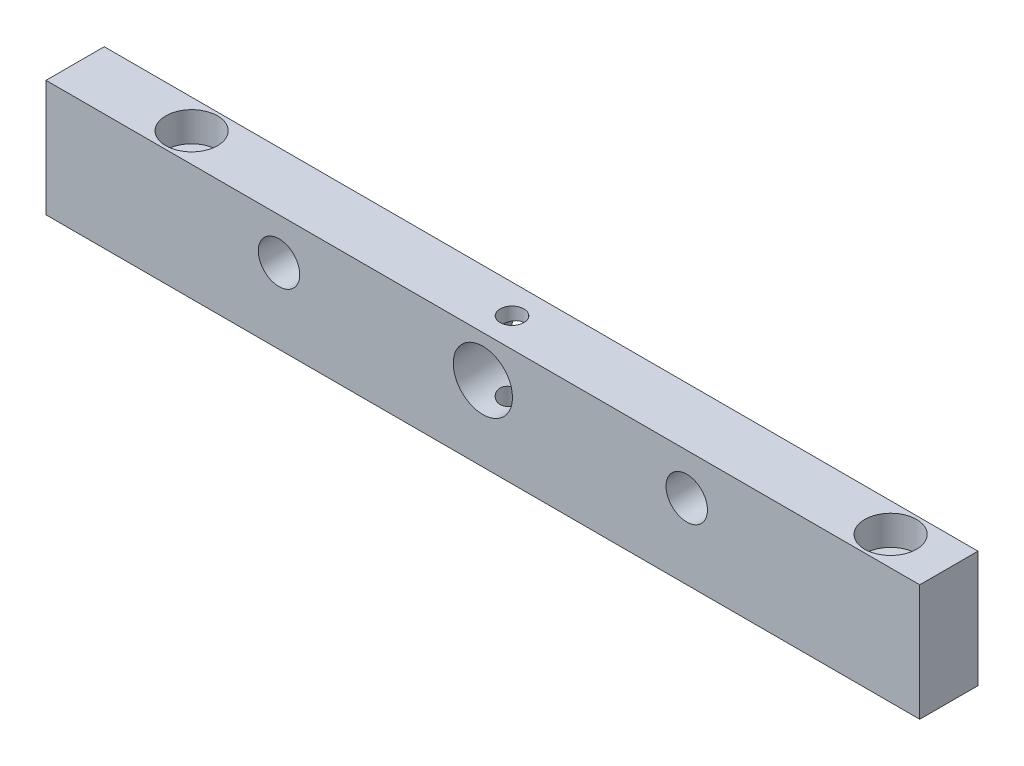
ISO-10303-21;
HEADER;
FILE_DESCRIPTION(('STEP AP214'),'2;1');
FILE_NAME('part.step','',(''),(''),'','','');
FILE_SCHEMA(('AUTOMOTIVE_DESIGN { 1 0 10303 214 1 1 1 1 }'));
ENDSEC;
DATA;
#1=APPLICATION_CONTEXT('core data for automotive mechanical design processes');
#2=APPLICATION_PROTOCOL_DEFINITION('international standard','automotive_design',2000,#1);
#3=PRODUCT_CONTEXT('',#1,'mechanical');
#4=PRODUCT('Part','Part','',(#3));
#5=PRODUCT_RELATED_PRODUCT_CATEGORY('part','',(#4));
#6=PRODUCT_DEFINITION_FORMATION('','',#4);
#7=PRODUCT_DEFINITION_CONTEXT('part definition',#1,'design');
#8=PRODUCT_DEFINITION('design','',#6,#7);
#9=PRODUCT_DEFINITION_SHAPE('','',#8);
#10=(LENGTH_UNIT() NAMED_UNIT(*) SI_UNIT(.MILLI.,.METRE.));
#11=(NAMED_UNIT(*) PLANE_ANGLE_UNIT() SI_UNIT($,.RADIAN.));
#12=(NAMED_UNIT(*) SI_UNIT($,.STERADIAN.) SOLID_ANGLE_UNIT());
#13=UNCERTAINTY_MEASURE_WITH_UNIT(LENGTH_MEASURE(1.E-05),#10,'distance_accuracy_value','');
#14=(GEOMETRIC_REPRESENTATION_CONTEXT(3) GLOBAL_UNCERTAINTY_ASSIGNED_CONTEXT((#13)) GLOBAL_UNIT_ASSIGNED_CONTEXT((#10,
#11,#12)) REPRESENTATION_CONTEXT('',''));
#15=CARTESIAN_POINT('',(0.,0.,0.));
#16=DIRECTION('',(0.,0.,1.));
#17=DIRECTION('',(1.,0.,0.));
#18=AXIS2_PLACEMENT_3D('',#15,#16,#17);
#19=CARTESIAN_POINT('',(-15.078556381928,25.,-5.48890968145176));
#20=DIRECTION('',(1.,0.,0.));
#21=DIRECTION('',(0.,0.,-1.));
#22=AXIS2_PLACEMENT_3D('',#19,#20,#21);
#23=PLANE('',#22);
#24=DIRECTION('',(0.,0.,1.));
#25=VECTOR('',#24,1.);
#26=CARTESIAN_POINT('',(-15.078556381928,0.,-5.48890968145176));
#27=LINE('',#26,#25);
#28=CARTESIAN_POINT('',(-15.078556381928,0.,-5.48890968145176));
#29=VERTEX_POINT('',#28);
#30=CARTESIAN_POINT('',(-15.078556381928,0.,7.01109031854824));
#31=VERTEX_POINT('',#30);
#32=EDGE_CURVE('E105',#29,#31,#27,.T.);
#33=ORIENTED_EDGE('',*,*,#32,.T.);
#34=DIRECTION('',(0.,-1.,0.));
#35=VECTOR('',#34,1.);
#36=CARTESIAN_POINT('',(-15.078556381928,25.,7.01109031854824));
#37=LINE('',#36,#35);
#38=CARTESIAN_POINT('',(-15.078556381928,25.,7.01109031854824));
#39=VERTEX_POINT('',#38);
#40=EDGE_CURVE('E11',#39,#31,#37,.T.);
#41=ORIENTED_EDGE('',*,*,#40,.F.);
#42=DIRECTION('',(0.,0.,1.));
#43=VECTOR('',#42,1.);
#44=CARTESIAN_POINT('',(-15.078556381928,25.,-5.48890968145176));
#45=LINE('',#44,#43);
#46=CARTESIAN_POINT('',(-15.078556381928,25.,-5.48890968145176));
#47=VERTEX_POINT('',#46);
#48=EDGE_CURVE('E92',#47,#39,#45,.T.);
#49=ORIENTED_EDGE('',*,*,#48,.F.);
#50=DIRECTION('',(0.,-1.,0.));
#51=VECTOR('',#50,1.);
#52=CARTESIAN_POINT('',(-15.078556381928,25.,-5.48890968145176));
#53=LINE('',#52,#51);
#54=EDGE_CURVE('E101',#47,#29,#53,.T.);
#55=ORIENTED_EDGE('',*,*,#54,.T.);
#56=EDGE_LOOP('',(#33,#41,#49,#55));
#57=FACE_BOUND('',#56,.T.);
#58=ADVANCED_FACE('F35',(#57),#23,.F.);
#59=CARTESIAN_POINT('',(-15.078556381928,25.,7.01109031854824));
#60=DIRECTION('',(0.,0.,-1.));
#61=DIRECTION('',(-1.,0.,0.));
#62=AXIS2_PLACEMENT_3D('',#59,#60,#61);
#63=PLANE('',#62);
#64=CARTESIAN_POINT('',(78.671443618072,16.11,7.01109031854824));
#65=DIRECTION('',(0.,0.,-1.));
#66=DIRECTION('',(-1.,0.,0.));
#67=AXIS2_PLACEMENT_3D('',#64,#65,#66);
#68=CIRCLE('',#67,6.35);
#69=CARTESIAN_POINT('',(72.321443618072,16.11,7.01109031854824));
#70=VERTEX_POINT('',#69);
#71=EDGE_CURVE('E324',#70,#70,#68,.F.);
#72=ORIENTED_EDGE('',*,*,#71,.F.);
#73=EDGE_LOOP('',(#72));
#74=FACE_BOUND('',#73,.T.);
#75=CARTESIAN_POINT('',(122.421443618072,16.11,7.01109031854824));
#76=DIRECTION('',(0.,0.,-1.));
#77=DIRECTION('',(-1.,0.,0.));
#78=AXIS2_PLACEMENT_3D('',#75,#76,#77);
#79=CIRCLE('',#78,4.445);
#80=CARTESIAN_POINT('',(117.976443618072,16.11,7.01109031854824));
#81=VERTEX_POINT('',#80);
#82=EDGE_CURVE('E318',#81,#81,#79,.F.);
#83=ORIENTED_EDGE('',*,*,#82,.F.);
#84=EDGE_LOOP('',(#83));
#85=FACE_BOUND('',#84,.T.);
#86=CARTESIAN_POINT('',(34.921443618072,16.11,7.01109031854824));
#87=DIRECTION('',(0.,0.,-1.));
#88=DIRECTION('',(-1.,0.,0.));
#89=AXIS2_PLACEMENT_3D('',#86,#87,#88);
#90=CIRCLE('',#89,4.44499999999999);
#91=CARTESIAN_POINT('',(30.476443618072,16.11,7.01109031854824));
#92=VERTEX_POINT('',#91);
#93=EDGE_CURVE('E309',#92,#92,#90,.F.);
#94=ORIENTED_EDGE('',*,*,#93,.F.);
#95=EDGE_LOOP('',(#94));
#96=FACE_BOUND('',#95,.T.);
#97=DIRECTION('',(1.,0.,0.));
#98=VECTOR('',#97,1.);
#99=CARTESIAN_POINT('',(-15.078556381928,0.,7.01109031854824));
#100=LINE('',#99,#98);
#101=CARTESIAN_POINT('',(172.421443618072,0.,7.01109031854824));
#102=VERTEX_POINT('',#101);
#103=EDGE_CURVE('E96',#31,#102,#100,.T.);
#104=ORIENTED_EDGE('',*,*,#103,.T.);
#105=DIRECTION('',(0.,-1.,0.));
#106=VECTOR('',#105,1.);
#107=CARTESIAN_POINT('',(172.421443618072,25.,7.01109031854824));
#108=LINE('',#107,#106);
#109=CARTESIAN_POINT('',(172.421443618072,25.,7.01109031854824));
#110=VERTEX_POINT('',#109);
#111=EDGE_CURVE('E48',#110,#102,#108,.T.);
#112=ORIENTED_EDGE('',*,*,#111,.F.);
#113=DIRECTION('',(1.,0.,0.));
#114=VECTOR('',#113,1.);
#115=CARTESIAN_POINT('',(-15.078556381928,25.,7.01109031854824));
#116=LINE('',#115,#114);
#117=EDGE_CURVE('E87',#39,#110,#116,.T.);
#118=ORIENTED_EDGE('',*,*,#117,.F.);
#119=ORIENTED_EDGE('',*,*,#40,.T.);
#120=EDGE_LOOP('',(#104,#112,#118,#119));
#121=FACE_BOUND('',#120,.T.);
#122=ADVANCED_FACE('F95',(#74,#85,#96,#121),#63,.F.);
#123=CARTESIAN_POINT('',(172.421443618072,25.,-5.48890968145176));
#124=DIRECTION('',(-1.,0.,0.));
#125=DIRECTION('',(0.,0.,1.));
#126=AXIS2_PLACEMENT_3D('',#123,#124,#125);
#127=PLANE('',#126);
#128=DIRECTION('',(0.,0.,-1.));
#129=VECTOR('',#128,1.);
#130=CARTESIAN_POINT('',(172.421443618072,0.,-5.48890968145176));
#131=LINE('',#130,#129);
#132=CARTESIAN_POINT('',(172.421443618072,0.,-5.48890968145176));
#133=VERTEX_POINT('',#132);
#134=EDGE_CURVE('E74',#102,#133,#131,.T.);
#135=ORIENTED_EDGE('',*,*,#134,.T.);
#136=DIRECTION('',(0.,-1.,0.));
#137=VECTOR('',#136,1.);
#138=CARTESIAN_POINT('',(172.421443618072,25.,-5.48890968145176));
#139=LINE('',#138,#137);
#140=CARTESIAN_POINT('',(172.421443618072,25.,-5.48890968145176));
#141=VERTEX_POINT('',#140);
#142=EDGE_CURVE('E97',#141,#133,#139,.T.);
#143=ORIENTED_EDGE('',*,*,#142,.F.);
#144=DIRECTION('',(0.,0.,-1.));
#145=VECTOR('',#144,1.);
#146=CARTESIAN_POINT('',(172.421443618072,25.,-5.48890968145176));
#147=LINE('',#146,#145);
#148=EDGE_CURVE('E90',#110,#141,#147,.T.);
#149=ORIENTED_EDGE('',*,*,#148,.F.);
#150=ORIENTED_EDGE('',*,*,#111,.T.);
#151=EDGE_LOOP('',(#135,#143,#149,#150));
#152=FACE_BOUND('',#151,.T.);
#153=ADVANCED_FACE('F99',(#152),#127,.F.);
#154=CARTESIAN_POINT('',(-15.078556381928,25.,-5.48890968145176));
#155=DIRECTION('',(0.,0.,1.));
#156=DIRECTION('',(1.,0.,0.));
#157=AXIS2_PLACEMENT_3D('',#154,#155,#156);
#158=PLANE('',#157);
#159=CARTESIAN_POINT('',(78.671443618072,16.11,-5.48890968145176));
#160=DIRECTION('',(0.,0.,-1.));
#161=DIRECTION('',(-1.,0.,0.));
#162=AXIS2_PLACEMENT_3D('',#159,#160,#161);
#163=CIRCLE('',#162,6.35);
#164=CARTESIAN_POINT('',(72.321443618072,16.11,-5.48890968145176));
#165=VERTEX_POINT('',#164);
#166=EDGE_CURVE('E321',#165,#165,#163,.T.);
#167=ORIENTED_EDGE('',*,*,#166,.F.);
#168=EDGE_LOOP('',(#167));
#169=FACE_BOUND('',#168,.T.);
#170=CARTESIAN_POINT('',(122.421443618072,16.11,-5.48890968145176));
#171=DIRECTION('',(0.,0.,-1.));
#172=DIRECTION('',(-1.,0.,0.));
#173=AXIS2_PLACEMENT_3D('',#170,#171,#172);
#174=CIRCLE('',#173,4.445);
#175=CARTESIAN_POINT('',(117.976443618072,16.11,-5.48890968145176));
#176=VERTEX_POINT('',#175);
#177=EDGE_CURVE('E315',#176,#176,#174,.T.);
#178=ORIENTED_EDGE('',*,*,#177,.F.);
#179=EDGE_LOOP('',(#178));
#180=FACE_BOUND('',#179,.T.);
#181=CARTESIAN_POINT('',(34.921443618072,16.11,-5.48890968145176));
#182=DIRECTION('',(0.,0.,-1.));
#183=DIRECTION('',(-1.,0.,0.));
#184=AXIS2_PLACEMENT_3D('',#181,#182,#183);
#185=CIRCLE('',#184,4.44499999999999);
#186=CARTESIAN_POINT('',(30.476443618072,16.11,-5.48890968145176));
#187=VERTEX_POINT('',#186);
#188=EDGE_CURVE('E312',#187,#187,#185,.T.);
#189=ORIENTED_EDGE('',*,*,#188,.F.);
#190=EDGE_LOOP('',(#189));
#191=FACE_BOUND('',#190,.T.);
#192=DIRECTION('',(-1.,0.,0.));
#193=VECTOR('',#192,1.);
#194=CARTESIAN_POINT('',(-15.078556381928,0.,-5.48890968145176));
#195=LINE('',#194,#193);
#196=EDGE_CURVE('E80',#133,#29,#195,.T.);
#197=ORIENTED_EDGE('',*,*,#196,.T.);
#198=ORIENTED_EDGE('',*,*,#54,.F.);
#199=DIRECTION('',(-1.,0.,0.));
#200=VECTOR('',#199,1.);
#201=CARTESIAN_POINT('',(-15.078556381928,25.,-5.48890968145176));
#202=LINE('',#201,#200);
#203=EDGE_CURVE('E57',#141,#47,#202,.T.);
#204=ORIENTED_EDGE('',*,*,#203,.F.);
#205=ORIENTED_EDGE('',*,*,#142,.T.);
#206=EDGE_LOOP('',(#197,#198,#204,#205));
#207=FACE_BOUND('',#206,.T.);
#208=ADVANCED_FACE('F153',(#169,#180,#191,#207),#158,.F.);
#209=CARTESIAN_POINT('',(0.,25.,0.));
#210=DIRECTION('',(0.,1.,0.));
#211=DIRECTION('',(0.,0.,1.));
#212=AXIS2_PLACEMENT_3D('',#209,#210,#211);
#213=PLANE('',#212);
#214=CARTESIAN_POINT('',(78.671443618072,25.,0.761090318548244));
#215=DIRECTION('',(0.,1.,0.));
#216=DIRECTION('',(0.,0.,1.));
#217=AXIS2_PLACEMENT_3D('',#214,#215,#216);
#218=CIRCLE('',#217,2.55269999999999);
#219=CARTESIAN_POINT('',(78.671443618072,25.,3.31379031854823));
#220=VERTEX_POINT('',#219);
#221=EDGE_CURVE('E328',#220,#220,#218,.T.);
#222=ORIENTED_EDGE('',*,*,#221,.F.);
#223=EDGE_LOOP('',(#222));
#224=FACE_BOUND('',#223,.T.);
#225=CARTESIAN_POINT('',(9.92144361807199,25.,0.761090318548267));
#226=DIRECTION('',(0.,1.,0.));
#227=DIRECTION('',(0.,0.,1.));
#228=AXIS2_PLACEMENT_3D('',#225,#226,#227);
#229=CIRCLE('',#228,5.55625);
#230=CARTESIAN_POINT('',(9.92144361807199,25.,6.31734031854826));
#231=VERTEX_POINT('',#230);
#232=EDGE_CURVE('E306',#231,#231,#229,.T.);
#233=ORIENTED_EDGE('',*,*,#232,.F.);
#234=EDGE_LOOP('',(#233));
#235=FACE_BOUND('',#234,.T.);
#236=CARTESIAN_POINT('',(159.921443726072,25.,0.761090318548267));
#237=DIRECTION('',(0.,1.,0.));
#238=DIRECTION('',(0.,0.,1.));
#239=AXIS2_PLACEMENT_3D('',#236,#237,#238);
#240=CIRCLE('',#239,5.55624999999998);
#241=CARTESIAN_POINT('',(159.921443726072,25.,6.31734031854825));
#242=VERTEX_POINT('',#241);
#243=EDGE_CURVE('E286',#242,#242,#240,.T.);
#244=ORIENTED_EDGE('',*,*,#243,.F.);
#245=EDGE_LOOP('',(#244));
#246=FACE_BOUND('',#245,.T.);
#247=ORIENTED_EDGE('',*,*,#48,.T.);
#248=ORIENTED_EDGE('',*,*,#117,.T.);
#249=ORIENTED_EDGE('',*,*,#148,.T.);
#250=ORIENTED_EDGE('',*,*,#203,.T.);
#251=EDGE_LOOP('',(#247,#248,#249,#250));
#252=FACE_BOUND('',#251,.T.);
#253=ADVANCED_FACE('F88',(#224,#235,#246,#252),#213,.T.);
#254=CARTESIAN_POINT('',(0.,0.,0.));
#255=DIRECTION('',(0.,1.,0.));
#256=DIRECTION('',(0.,0.,1.));
#257=AXIS2_PLACEMENT_3D('',#254,#255,#256);
#258=PLANE('',#257);
#259=CARTESIAN_POINT('',(78.671443618072,0.,0.761090318548244));
#260=DIRECTION('',(0.,1.,0.));
#261=DIRECTION('',(0.,0.,1.));
#262=AXIS2_PLACEMENT_3D('',#259,#260,#261);
#263=CIRCLE('',#262,2.55269999999999);
#264=CARTESIAN_POINT('',(78.671443618072,0.,3.31379031854823));
#265=VERTEX_POINT('',#264);
#266=EDGE_CURVE('E117',#265,#265,#263,.T.);
#267=ORIENTED_EDGE('',*,*,#266,.T.);
#268=EDGE_LOOP('',(#267));
#269=FACE_BOUND('',#268,.T.);
#270=CARTESIAN_POINT('',(9.92144361807199,0.,0.761090318548267));
#271=DIRECTION('',(0.,1.,0.));
#272=DIRECTION('',(0.,0.,1.));
#273=AXIS2_PLACEMENT_3D('',#270,#271,#272);
#274=CIRCLE('',#273,3.3782);
#275=CARTESIAN_POINT('',(9.92144361807199,0.,4.13929031854826));
#276=VERTEX_POINT('',#275);
#277=EDGE_CURVE('E290',#276,#276,#274,.T.);
#278=ORIENTED_EDGE('',*,*,#277,.T.);
#279=EDGE_LOOP('',(#278));
#280=FACE_BOUND('',#279,.T.);
#281=CARTESIAN_POINT('',(159.921443726072,0.,0.761090318548267));
#282=DIRECTION('',(0.,1.,0.));
#283=DIRECTION('',(0.,0.,1.));
#284=AXIS2_PLACEMENT_3D('',#281,#282,#283);
#285=CIRCLE('',#284,3.3782);
#286=CARTESIAN_POINT('',(159.921443726072,0.,4.13929031854827));
#287=VERTEX_POINT('',#286);
#288=EDGE_CURVE('E108',#287,#287,#285,.T.);
#289=ORIENTED_EDGE('',*,*,#288,.T.);
#290=EDGE_LOOP('',(#289));
#291=FACE_BOUND('',#290,.T.);
#292=ORIENTED_EDGE('',*,*,#32,.F.);
#293=ORIENTED_EDGE('',*,*,#196,.F.);
#294=ORIENTED_EDGE('',*,*,#134,.F.);
#295=ORIENTED_EDGE('',*,*,#103,.F.);
#296=EDGE_LOOP('',(#292,#293,#294,#295));
#297=FACE_BOUND('',#296,.T.);
#298=ADVANCED_FACE('F141',(#269,#280,#291,#297),#258,.F.);
#299=CARTESIAN_POINT('',(159.921443726072,25.,0.761090318548267));
#300=DIRECTION('',(0.,1.,0.));
#301=DIRECTION('',(0.,0.,1.));
#302=AXIS2_PLACEMENT_3D('',#299,#300,#301);
#303=CYLINDRICAL_SURFACE('',#302,3.3782);
#304=ORIENTED_EDGE('',*,*,#288,.F.);
#305=EDGE_LOOP('',(#304));
#306=FACE_BOUND('',#305,.T.);
#307=CARTESIAN_POINT('',(159.921443726072,18.65,0.761090318548267));
#308=DIRECTION('',(0.,1.,0.));
#309=DIRECTION('',(0.,0.,1.));
#310=AXIS2_PLACEMENT_3D('',#307,#308,#309);
#311=CIRCLE('',#310,3.3782);
#312=CARTESIAN_POINT('',(159.921443726072,18.65,4.13929031854827));
#313=VERTEX_POINT('',#312);
#314=EDGE_CURVE('E282',#313,#313,#311,.T.);
#315=ORIENTED_EDGE('',*,*,#314,.T.);
#316=EDGE_LOOP('',(#315));
#317=FACE_BOUND('',#316,.T.);
#318=ADVANCED_FACE('F143',(#306,#317),#303,.F.);
#319=CARTESIAN_POINT('',(163.299643726072,18.65,0.761090318548267));
#320=DIRECTION('',(0.,-1.,0.));
#321=DIRECTION('',(0.,0.,-1.));
#322=AXIS2_PLACEMENT_3D('',#319,#320,#321);
#323=PLANE('',#322);
#324=ORIENTED_EDGE('',*,*,#314,.F.);
#325=EDGE_LOOP('',(#324));
#326=FACE_BOUND('',#325,.T.);
#327=CARTESIAN_POINT('',(159.921443726072,18.65,0.761090318548267));
#328=DIRECTION('',(0.,1.,0.));
#329=DIRECTION('',(0.,0.,1.));
#330=AXIS2_PLACEMENT_3D('',#327,#328,#329);
#331=CIRCLE('',#330,5.55624999999998);
#332=CARTESIAN_POINT('',(159.921443726072,18.65,6.31734031854825));
#333=VERTEX_POINT('',#332);
#334=EDGE_CURVE('E285',#333,#333,#331,.T.);
#335=ORIENTED_EDGE('',*,*,#334,.T.);
#336=EDGE_LOOP('',(#335));
#337=FACE_BOUND('',#336,.T.);
#338=ADVANCED_FACE('F150',(#326,#337),#323,.F.);
#339=CARTESIAN_POINT('',(159.921443726072,25.,0.761090318548267));
#340=DIRECTION('',(0.,1.,0.));
#341=DIRECTION('',(0.,0.,1.));
#342=AXIS2_PLACEMENT_3D('',#339,#340,#341);
#343=CYLINDRICAL_SURFACE('',#342,5.55624999999998);
#344=ORIENTED_EDGE('',*,*,#334,.F.);
#345=EDGE_LOOP('',(#344));
#346=FACE_BOUND('',#345,.T.);
#347=ORIENTED_EDGE('',*,*,#243,.T.);
#348=EDGE_LOOP('',(#347));
#349=FACE_BOUND('',#348,.T.);
#350=ADVANCED_FACE('F243',(#346,#349),#343,.F.);
#351=CARTESIAN_POINT('',(9.92144361807199,25.,0.761090318548267));
#352=DIRECTION('',(0.,1.,0.));
#353=DIRECTION('',(0.,0.,1.));
#354=AXIS2_PLACEMENT_3D('',#351,#352,#353);
#355=CYLINDRICAL_SURFACE('',#354,3.3782);
#356=ORIENTED_EDGE('',*,*,#277,.F.);
#357=EDGE_LOOP('',(#356));
#358=FACE_BOUND('',#357,.T.);
#359=CARTESIAN_POINT('',(9.92144361807199,18.65,0.761090318548267));
#360=DIRECTION('',(0.,1.,0.));
#361=DIRECTION('',(0.,0.,1.));
#362=AXIS2_PLACEMENT_3D('',#359,#360,#361);
#363=CIRCLE('',#362,3.3782);
#364=CARTESIAN_POINT('',(9.92144361807199,18.65,4.13929031854826));
#365=VERTEX_POINT('',#364);
#366=EDGE_CURVE('E300',#365,#365,#363,.T.);
#367=ORIENTED_EDGE('',*,*,#366,.T.);
#368=EDGE_LOOP('',(#367));
#369=FACE_BOUND('',#368,.T.);
#370=ADVANCED_FACE('F235',(#358,#369),#355,.F.);
#371=CARTESIAN_POINT('',(13.299643618072,18.65,0.761090318548267));
#372=DIRECTION('',(0.,-1.,0.));
#373=DIRECTION('',(0.,0.,-1.));
#374=AXIS2_PLACEMENT_3D('',#371,#372,#373);
#375=PLANE('',#374);
#376=ORIENTED_EDGE('',*,*,#366,.F.);
#377=EDGE_LOOP('',(#376));
#378=FACE_BOUND('',#377,.T.);
#379=CARTESIAN_POINT('',(9.92144361807199,18.65,0.761090318548267));
#380=DIRECTION('',(0.,1.,0.));
#381=DIRECTION('',(0.,0.,1.));
#382=AXIS2_PLACEMENT_3D('',#379,#380,#381);
#383=CIRCLE('',#382,5.55625);
#384=CARTESIAN_POINT('',(9.92144361807199,18.65,6.31734031854826));
#385=VERTEX_POINT('',#384);
#386=EDGE_CURVE('E303',#385,#385,#383,.T.);
#387=ORIENTED_EDGE('',*,*,#386,.T.);
#388=EDGE_LOOP('',(#387));
#389=FACE_BOUND('',#388,.T.);
#390=ADVANCED_FACE('F227',(#378,#389),#375,.F.);
#391=CARTESIAN_POINT('',(9.92144361807199,25.,0.761090318548267));
#392=DIRECTION('',(0.,1.,0.));
#393=DIRECTION('',(0.,0.,1.));
#394=AXIS2_PLACEMENT_3D('',#391,#392,#393);
#395=CYLINDRICAL_SURFACE('',#394,5.55625);
#396=ORIENTED_EDGE('',*,*,#386,.F.);
#397=EDGE_LOOP('',(#396));
#398=FACE_BOUND('',#397,.T.);
#399=ORIENTED_EDGE('',*,*,#232,.T.);
#400=EDGE_LOOP('',(#399));
#401=FACE_BOUND('',#400,.T.);
#402=ADVANCED_FACE('F219',(#398,#401),#395,.F.);
#403=CARTESIAN_POINT('',(34.921443618072,16.11,7.01209031854824));
#404=DIRECTION('',(0.,0.,-1.));
#405=DIRECTION('',(-1.,0.,0.));
#406=AXIS2_PLACEMENT_3D('',#403,#404,#405);
#407=CYLINDRICAL_SURFACE('',#406,4.44499999999999);
#408=ORIENTED_EDGE('',*,*,#188,.T.);
#409=EDGE_LOOP('',(#408));
#410=FACE_BOUND('',#409,.T.);
#411=ORIENTED_EDGE('',*,*,#93,.T.);
#412=EDGE_LOOP('',(#411));
#413=FACE_BOUND('',#412,.T.);
#414=ADVANCED_FACE('F215',(#410,#413),#407,.F.);
#415=CARTESIAN_POINT('',(122.421443618072,16.11,7.01209031854825));
#416=DIRECTION('',(0.,0.,-1.));
#417=DIRECTION('',(-1.,0.,0.));
#418=AXIS2_PLACEMENT_3D('',#415,#416,#417);
#419=CYLINDRICAL_SURFACE('',#418,4.445);
#420=ORIENTED_EDGE('',*,*,#177,.T.);
#421=EDGE_LOOP('',(#420));
#422=FACE_BOUND('',#421,.T.);
#423=ORIENTED_EDGE('',*,*,#82,.T.);
#424=EDGE_LOOP('',(#423));
#425=FACE_BOUND('',#424,.T.);
#426=ADVANCED_FACE('F183',(#422,#425),#419,.F.);
#427=CARTESIAN_POINT('',(78.671443618072,16.11,7.01209031854824));
#428=DIRECTION('',(0.,0.,-1.));
#429=DIRECTION('',(-1.,0.,0.));
#430=AXIS2_PLACEMENT_3D('',#427,#428,#429);
#431=CYLINDRICAL_SURFACE('',#430,6.35);
#432=CARTESIAN_POINT('',(78.671443618072,9.76000000000001,3.31379031854823));
#433=CARTESIAN_POINT('',(78.5342910275086,9.76000695193127,3.31378097955258));
#434=CARTESIAN_POINT('',(78.3969174387737,9.76449429145972,3.30267322057806));
#435=CARTESIAN_POINT('',(78.1260374072043,9.78200140375589,3.25863635200131));
#436=CARTESIAN_POINT('',(77.9925424519429,9.79504426410509,3.22564819414416));
#437=CARTESIAN_POINT('',(77.7337851387783,9.82826033152891,3.13924287508518));
#438=CARTESIAN_POINT('',(77.6084972849598,9.84841008018786,3.08589287723378));
#439=CARTESIAN_POINT('',(77.3687640987907,9.89385718057557,2.96054719944265));
#440=CARTESIAN_POINT('',(77.2543150780239,9.91915277190092,2.88855789375737));
#441=CARTESIAN_POINT('',(77.0339082236577,9.97368000171478,2.72436487584246));
#442=CARTESIAN_POINT('',(76.9285324054101,10.0030346225478,2.63142102839832));
#443=CARTESIAN_POINT('',(76.7343703821413,10.0618136104787,2.42951979130504));
#444=CARTESIAN_POINT('',(76.6455923647313,10.0912380047861,2.32055454547853));
#445=CARTESIAN_POINT('',(76.4832054863922,10.1483001372008,2.08374317393659));
#446=CARTESIAN_POINT('',(76.4104602194872,10.1757976603096,1.95526759092073));
#447=CARTESIAN_POINT('',(76.2878718337146,10.2239609237356,1.68663386192061));
#448=CARTESIAN_POINT('',(76.2380177281602,10.2446299400778,1.54648135855321));
#449=CARTESIAN_POINT('',(76.1649865569268,10.275474410188,1.26516129201472));
#450=CARTESIAN_POINT('',(76.1406945550162,10.2860862197889,1.12433277125066));
#451=CARTESIAN_POINT('',(76.1159949035087,10.296878412565,0.840229318006984));
#452=CARTESIAN_POINT('',(76.1155753459108,10.2970639965269,0.696955640893327));
#453=CARTESIAN_POINT('',(76.137788164677,10.2873546590891,0.422788646913135));
#454=CARTESIAN_POINT('',(76.1587993554428,10.2781686642624,0.291733978559869));
#455=CARTESIAN_POINT('',(76.2205721844244,10.2519420301842,0.035197272304217));
#456=CARTESIAN_POINT('',(76.261337307361,10.2349000051042,-0.0902837781109768));
#457=CARTESIAN_POINT('',(76.3622393700047,10.1945059345715,-0.335155823476884));
#458=CARTESIAN_POINT('',(76.4227566337932,10.1710315899271,-0.4543690272231));
#459=CARTESIAN_POINT('',(76.5611778844472,10.1204508493915,-0.681389457203357));
#460=CARTESIAN_POINT('',(76.6390884421858,10.0933430824094,-0.789192350078996));
#461=CARTESIAN_POINT('',(76.8172400786182,10.0359700780286,-0.999197486470372));
#462=CARTESIAN_POINT('',(76.9187504252493,10.005623639758,-1.10030370683345));
#463=CARTESIAN_POINT('',(77.137606493084,9.94699202346783,-1.28441053962592));
#464=CARTESIAN_POINT('',(77.2549554234707,9.9187072649751,-1.36740747384614));
#465=CARTESIAN_POINT('',(77.5052925253656,9.86666448074812,-1.51439773117967));
#466=CARTESIAN_POINT('',(77.638548020695,9.84300906954198,-1.57797476177377));
#467=CARTESIAN_POINT('',(77.915055142277,9.80366748127336,-1.68143133498506));
#468=CARTESIAN_POINT('',(78.0583015955966,9.78797721449677,-1.72132304065218));
#469=CARTESIAN_POINT('',(78.3415406677904,9.76708135863064,-1.77405082868554));
#470=CARTESIAN_POINT('',(78.481217223293,9.76130589632944,-1.78835959035144));
#471=CARTESIAN_POINT('',(78.7610818163908,9.75909245541938,-1.79386876686872));
#472=CARTESIAN_POINT('',(78.9012697101184,9.76265202645421,-1.78507524584566));
#473=CARTESIAN_POINT('',(79.1714762953813,9.77833606070616,-1.74570901357163));
#474=CARTESIAN_POINT('',(79.3016675155635,9.79006363758629,-1.71614498915851));
#475=CARTESIAN_POINT('',(79.5551187927577,9.82049110878906,-1.63745315885039));
#476=CARTESIAN_POINT('',(79.6783779585989,9.83919189722634,-1.58832284408411));
#477=CARTESIAN_POINT('',(79.9187198030849,9.8824662447856,-1.47028910624298));
#478=CARTESIAN_POINT('',(80.0354972587533,9.90720227810128,-1.40082564358995));
#479=CARTESIAN_POINT('',(80.2561496118635,9.95987026986238,-1.24471801325101));
#480=CARTESIAN_POINT('',(80.3600192825722,9.98780351421211,-1.15806692243357));
#481=CARTESIAN_POINT('',(80.5591741487056,10.0461356159372,-0.963270427239609));
#482=CARTESIAN_POINT('',(80.6534253085682,10.0765746944739,-0.854077142832699));
#483=CARTESIAN_POINT('',(80.8225241563819,10.1347702340363,-0.620891828157536));
#484=CARTESIAN_POINT('',(80.8973685122909,10.1625262338798,-0.496897261920116));
#485=CARTESIAN_POINT('',(81.0260400810017,10.2122711477268,-0.235680437008604));
#486=CARTESIAN_POINT('',(81.0796452103056,10.2341983716803,-0.0983361933629369));
#487=CARTESIAN_POINT('',(81.1625470769,10.2688562090829,0.184578381504007));
#488=CARTESIAN_POINT('',(81.1918620005112,10.2815937020501,0.330142471061428));
#489=CARTESIAN_POINT('',(81.2236057911166,10.2954286254139,0.613981200994122));
#490=CARTESIAN_POINT('',(81.2278314642335,10.2973037243171,0.752018194917314));
#491=CARTESIAN_POINT('',(81.2140044841576,10.2912422810256,1.02673834068979));
#492=CARTESIAN_POINT('',(81.1959547243269,10.2833070131019,1.16342166604309));
#493=CARTESIAN_POINT('',(81.1395617152256,10.2592079193855,1.42590086503871));
#494=CARTESIAN_POINT('',(81.1020665366951,10.2433889707465,1.55191351119605));
#495=CARTESIAN_POINT('',(81.0086448290789,10.2055510486559,1.79590735199853));
#496=CARTESIAN_POINT('',(80.9527131986747,10.1835303594447,1.91388631282976));
#497=CARTESIAN_POINT('',(80.8202834186383,10.1341948715968,2.14587114893941));
#498=CARTESIAN_POINT('',(80.7427859640235,10.1066481445318,2.25925644858914));
#499=CARTESIAN_POINT('',(80.5708809133344,10.0500642008479,2.47197672928418));
#500=CARTESIAN_POINT('',(80.4764681274474,10.0210265287465,2.57130738141937));
#501=CARTESIAN_POINT('',(80.2660116494101,9.96243739012058,2.75980465897285));
#502=CARTESIAN_POINT('',(80.1489537503885,9.93297771889437,2.84787326647654));
#503=CARTESIAN_POINT('',(79.9006451983813,9.87881081798238,3.00314334328497));
#504=CARTESIAN_POINT('',(79.7693880037219,9.85410579347274,3.07033513888539));
#505=CARTESIAN_POINT('',(79.4985931783135,9.81264670684212,3.18038987606216));
#506=CARTESIAN_POINT('',(79.359252464747,9.79575464738758,3.2236779179915));
#507=CARTESIAN_POINT('',(79.1460261091425,9.77735428833711,3.27034500972839));
#508=CARTESIAN_POINT('',(79.0743142370641,9.77237848481169,3.28285349140889));
#509=CARTESIAN_POINT('',(78.9299707908443,9.7648555314434,3.30170426970074));
#510=CARTESIAN_POINT('',(78.857339901707,9.76230666956844,3.3080509131063));
#511=CARTESIAN_POINT('',(78.7468981854301,9.76033533966996,3.31295530767993));
#512=CARTESIAN_POINT('',(78.7091792665266,9.75999808727176,3.31379288804441));
#513=CARTESIAN_POINT('',(78.671443618072,9.76000000000001,3.31379031854823));
#514=B_SPLINE_CURVE_WITH_KNOTS('',3,(#432,#433,#434,#435,#436,#437,#438,#439,#440,#441,#442,
#443,#444,#445,#446,#447,#448,#449,#450,#451,#452,#453,#454,#455,#456,#457,#458,#459,#460,#461,
#462,#463,#464,#465,#466,#467,#468,#469,#470,#471,#472,#473,#474,#475,#476,#477,#478,#479,#480,
#481,#482,#483,#484,#485,#486,#487,#488,#489,#490,#491,#492,#493,#494,#495,#496,#497,#498,#499,
#500,#501,#502,#503,#504,#505,#506,#507,#508,#509,#510,#511,#512,#513),.UNSPECIFIED.,.T.,.F.,(4,
2,2,2,2,2,2,2,2,2,2,2,2,2,2,2,2,2,2,2,2,2,2,2,2,2,2,2,2,2,2,2,2,2,2,2,2,2,2,2,4),(0.,
0.411331059515128,0.823776712244995,1.23487351245121,1.64582991138899,2.07457553263975,
2.50353209708504,2.95181404932943,3.39988062173097,3.82747226722299,4.2548506205057,
4.65213393839024,5.04948736513311,5.45499402143406,5.86065413086401,6.29801539594673,
6.73546541172751,7.18172360768629,7.62775243943513,8.04716062825999,8.46645873749578,
8.86668753121306,9.26696766046534,9.67951990853168,10.092238670252,10.5324737496029,
10.9727843649352,11.417584621804,11.8620515505695,12.2742621542482,12.6864192214155,
13.0819487597494,13.4775878320837,13.8960224723142,14.3145857135078,14.760675264033,
15.2069712122026,15.6450512739016,15.8636998845329,16.0821941398345,16.1953662220864),.UNSPECIFIED.);
#515=CARTESIAN_POINT('',(78.671443618072,9.76000000000001,3.31379031854823));
#516=VERTEX_POINT('',#515);
#517=EDGE_CURVE('E38',#516,#516,#514,.T.);
#518=ORIENTED_EDGE('',*,*,#517,.T.);
#519=EDGE_LOOP('',(#518));
#520=FACE_BOUND('',#519,.T.);
#521=CARTESIAN_POINT('',(78.671443618072,22.46,3.31379031854823));
#522=CARTESIAN_POINT('',(78.8085962086354,22.4599930480687,3.31378097955258));
#523=CARTESIAN_POINT('',(78.9459697973703,22.4555057085403,3.30267322057806));
#524=CARTESIAN_POINT('',(79.2168498289397,22.4379985962441,3.25863635200131));
#525=CARTESIAN_POINT('',(79.3503447842011,22.4249557358949,3.22564819414416));
#526=CARTESIAN_POINT('',(79.6091020973657,22.3917396684711,3.13924287508518));
#527=CARTESIAN_POINT('',(79.7343899511842,22.3715899198121,3.08589287723378));
#528=CARTESIAN_POINT('',(79.9741231373533,22.3261428194244,2.96054719944265));
#529=CARTESIAN_POINT('',(80.0885721581201,22.3008472280991,2.88855789375737));
#530=CARTESIAN_POINT('',(80.3089790124862,22.2463199982852,2.72436487584246));
#531=CARTESIAN_POINT('',(80.4143548307339,22.2169653774522,2.63142102839833));
#532=CARTESIAN_POINT('',(80.6085168540026,22.1581863895213,2.42951979130505));
#533=CARTESIAN_POINT('',(80.6972948714127,22.1287619952139,2.32055454547853));
#534=CARTESIAN_POINT('',(80.8596817497518,22.0716998627992,2.08374317393659));
#535=CARTESIAN_POINT('',(80.9324270166567,22.0442023396904,1.95526759092073));
#536=CARTESIAN_POINT('',(81.0550154024294,21.9960390762644,1.68663386192061));
#537=CARTESIAN_POINT('',(81.1048695079837,21.9753700599222,1.54648135855321));
#538=CARTESIAN_POINT('',(81.1779006792172,21.944525589812,1.26516129201472));
#539=CARTESIAN_POINT('',(81.2021926811278,21.9339137802111,1.12433277125066));
#540=CARTESIAN_POINT('',(81.2268923326353,21.923121587435,0.840229318006983));
#541=CARTESIAN_POINT('',(81.2273118902331,21.9229360034731,0.696955640893325));
#542=CARTESIAN_POINT('',(81.2050990714669,21.9326453409109,0.422788646913134));
#543=CARTESIAN_POINT('',(81.1840878807012,21.9418313357376,0.291733978559867));
#544=CARTESIAN_POINT('',(81.1223150517195,21.9680579698158,0.0351972723042155));
#545=CARTESIAN_POINT('',(81.081549928783,21.9850999948958,-0.0902837781109779));
#546=CARTESIAN_POINT('',(80.9806478661393,22.0254940654285,-0.335155823476886));
#547=CARTESIAN_POINT('',(80.9201306023508,22.0489684100729,-0.454369027223101));
#548=CARTESIAN_POINT('',(80.7817093516968,22.0995491506085,-0.681389457203359));
#549=CARTESIAN_POINT('',(80.7037987939581,22.1266569175906,-0.789192350078999));
#550=CARTESIAN_POINT('',(80.5256471575258,22.1840299219714,-0.999197486470379));
#551=CARTESIAN_POINT('',(80.4241368108947,22.214376360242,-1.10030370683346));
#552=CARTESIAN_POINT('',(80.20528074306,22.2730079765322,-1.28441053962593));
#553=CARTESIAN_POINT('',(80.0879318126733,22.3012927350249,-1.36740747384614));
#554=CARTESIAN_POINT('',(79.8375947107784,22.3533355192519,-1.51439773117967));
#555=CARTESIAN_POINT('',(79.704339215449,22.376990930458,-1.57797476177378));
#556=CARTESIAN_POINT('',(79.427832093867,22.4163325187266,-1.68143133498507));
#557=CARTESIAN_POINT('',(79.2845856405474,22.4320227855032,-1.72132304065218));
#558=CARTESIAN_POINT('',(79.0013465683536,22.4529186413694,-1.77405082868554));
#559=CARTESIAN_POINT('',(78.861670012851,22.4586941036706,-1.78835959035144));
#560=CARTESIAN_POINT('',(78.5818054197531,22.4609075445806,-1.79386876686872));
#561=CARTESIAN_POINT('',(78.4416175260255,22.4573479735458,-1.78507524584566));
#562=CARTESIAN_POINT('',(78.1714109407627,22.4416639392938,-1.74570901357163));
#563=CARTESIAN_POINT('',(78.0412197205805,22.4299363624137,-1.71614498915851));
#564=CARTESIAN_POINT('',(77.7877684433863,22.3995088912109,-1.63745315885039));
#565=CARTESIAN_POINT('',(77.664509277545,22.3808081027737,-1.58832284408411));
#566=CARTESIAN_POINT('',(77.4241674330591,22.3375337552144,-1.47028910624298));
#567=CARTESIAN_POINT('',(77.3073899773907,22.3127977218987,-1.40082564358995));
#568=CARTESIAN_POINT('',(77.0867376242805,22.2601297301376,-1.24471801325101));
#569=CARTESIAN_POINT('',(76.9828679535718,22.2321964857879,-1.15806692243357));
#570=CARTESIAN_POINT('',(76.7837130874384,22.1738643840628,-0.963270427239609));
#571=CARTESIAN_POINT('',(76.6894619275757,22.1434253055262,-0.854077142832699));
#572=CARTESIAN_POINT('',(76.520363079762,22.0852297659637,-0.620891828157536));
#573=CARTESIAN_POINT('',(76.4455187238531,22.0574737661202,-0.496897261920116));
#574=CARTESIAN_POINT('',(76.3168471551423,22.0077288522732,-0.235680437008604));
#575=CARTESIAN_POINT('',(76.2632420258384,21.9858016283197,-0.0983361933629366));
#576=CARTESIAN_POINT('',(76.180340159244,21.9511437909171,0.184578381504008));
#577=CARTESIAN_POINT('',(76.1510252356327,21.9384062979499,0.33014247106143));
#578=CARTESIAN_POINT('',(76.1192814450274,21.9245713745861,0.613981200994124));
#579=CARTESIAN_POINT('',(76.1150557719105,21.9226962756829,0.752018194917316));
#580=CARTESIAN_POINT('',(76.1288827519863,21.9287577189744,1.02673834068979));
#581=CARTESIAN_POINT('',(76.1469325118171,21.9366929868981,1.16342166604309));
#582=CARTESIAN_POINT('',(76.2033255209183,21.9607920806145,1.42590086503871));
#583=CARTESIAN_POINT('',(76.2408206994489,21.9766110292536,1.55191351119605));
#584=CARTESIAN_POINT('',(76.334242407065,22.0144489513441,1.79590735199853));
#585=CARTESIAN_POINT('',(76.3901740374693,22.0364696405554,1.91388631282976));
#586=CARTESIAN_POINT('',(76.5226038175056,22.0858051284032,2.14587114893941));
#587=CARTESIAN_POINT('',(76.6001012721205,22.1133518554682,2.25925644858914));
#588=CARTESIAN_POINT('',(76.7720063228095,22.1699357991521,2.47197672928418));
#589=CARTESIAN_POINT('',(76.8664191086966,22.1989734712535,2.57130738141937));
#590=CARTESIAN_POINT('',(77.0768755867339,22.2575626098794,2.75980465897285));
#591=CARTESIAN_POINT('',(77.1939334857555,22.2870222811056,2.84787326647654));
#592=CARTESIAN_POINT('',(77.4422420377627,22.3411891820176,3.00314334328497));
#593=CARTESIAN_POINT('',(77.5734992324221,22.3658942065273,3.07033513888539));
#594=CARTESIAN_POINT('',(77.8442940578305,22.4073532931579,3.18038987606216));
#595=CARTESIAN_POINT('',(77.9836347713969,22.4242453526124,3.2236779179915));
#596=CARTESIAN_POINT('',(78.1968611270015,22.4426457116629,3.27034500972839));
#597=CARTESIAN_POINT('',(78.2685729990799,22.4476215151883,3.28285349140889));
#598=CARTESIAN_POINT('',(78.4129164452997,22.4551444685566,3.30170426970074));
#599=CARTESIAN_POINT('',(78.485547334437,22.4576933304316,3.3080509131063));
#600=CARTESIAN_POINT('',(78.5959890507138,22.45966466033,3.31295530767993));
#601=CARTESIAN_POINT('',(78.6337079696174,22.4600019127282,3.31379288804441));
#602=CARTESIAN_POINT('',(78.671443618072,22.46,3.31379031854823));
#603=B_SPLINE_CURVE_WITH_KNOTS('',3,(#521,#522,#523,#524,#525,#526,#527,#528,#529,#530,#531,
#532,#533,#534,#535,#536,#537,#538,#539,#540,#541,#542,#543,#544,#545,#546,#547,#548,#549,#550,
#551,#552,#553,#554,#555,#556,#557,#558,#559,#560,#561,#562,#563,#564,#565,#566,#567,#568,#569,
#570,#571,#572,#573,#574,#575,#576,#577,#578,#579,#580,#581,#582,#583,#584,#585,#586,#587,#588,
#589,#590,#591,#592,#593,#594,#595,#596,#597,#598,#599,#600,#601,#602),.UNSPECIFIED.,.T.,.F.,(4,
2,2,2,2,2,2,2,2,2,2,2,2,2,2,2,2,2,2,2,2,2,2,2,2,2,2,2,2,2,2,2,2,2,2,2,2,2,2,2,4),(0.,
0.411331059515128,0.823776712244995,1.23487351245121,1.64582991138899,2.07457553263974,
2.50353209708504,2.95181404932943,3.39988062173098,3.82747226722299,4.2548506205057,
4.65213393839024,5.04948736513311,5.45499402143406,5.86065413086401,6.29801539594675,
6.73546541172751,7.1817236076863,7.62775243943513,8.04716062826002,8.46645873749578,
8.86668753121304,9.26696766046534,9.67951990853168,10.092238670252,10.5324737496029,
10.9727843649352,11.417584621804,11.8620515505695,12.2742621542482,12.6864192214155,
13.0819487597494,13.4775878320837,13.8960224723142,14.3145857135079,14.760675264033,
15.2069712122026,15.6450512739016,15.863699884533,16.0821941398345,16.1953662220864),.UNSPECIFIED.);
#604=CARTESIAN_POINT('',(78.671443618072,22.46,3.31379031854823));
#605=VERTEX_POINT('',#604);
#606=EDGE_CURVE('E113',#605,#605,#603,.T.);
#607=ORIENTED_EDGE('',*,*,#606,.T.);
#608=EDGE_LOOP('',(#607));
#609=FACE_BOUND('',#608,.T.);
#610=ORIENTED_EDGE('',*,*,#166,.T.);
#611=EDGE_LOOP('',(#610));
#612=FACE_BOUND('',#611,.T.);
#613=ORIENTED_EDGE('',*,*,#71,.T.);
#614=EDGE_LOOP('',(#613));
#615=FACE_BOUND('',#614,.T.);
#616=ADVANCED_FACE('F118',(#520,#609,#612,#615),#431,.F.);
#617=CARTESIAN_POINT('',(78.671443618072,25.,0.761090318548244));
#618=DIRECTION('',(0.,1.,0.));
#619=DIRECTION('',(0.,0.,1.));
#620=AXIS2_PLACEMENT_3D('',#617,#618,#619);
#621=CYLINDRICAL_SURFACE('',#620,2.55269999999999);
#622=ORIENTED_EDGE('',*,*,#221,.T.);
#623=EDGE_LOOP('',(#622));
#624=FACE_BOUND('',#623,.T.);
#625=ORIENTED_EDGE('',*,*,#606,.F.);
#626=EDGE_LOOP('',(#625));
#627=FACE_BOUND('',#626,.T.);
#628=ADVANCED_FACE('F124',(#624,#627),#621,.F.);
#629=ORIENTED_EDGE('',*,*,#266,.F.);
#630=EDGE_LOOP('',(#629));
#631=FACE_BOUND('',#630,.T.);
#632=ORIENTED_EDGE('',*,*,#517,.F.);
#633=EDGE_LOOP('',(#632));
#634=FACE_BOUND('',#633,.T.);
#635=ADVANCED_FACE('F121',(#631,#634),#621,.F.);
#636=CLOSED_SHELL('',(#58,#122,#153,#208,#253,#298,#318,#338,#350,#370,#390,#402,#414,#426,#616,
#628,#635));
#637=MANIFOLD_SOLID_BREP('B2',#636);
#638=ADVANCED_BREP_SHAPE_REPRESENTATION('',(#18,#637),#14);
#639=SHAPE_DEFINITION_REPRESENTATION(#9,#638);
ENDSEC;
END-ISO-10303-21;
